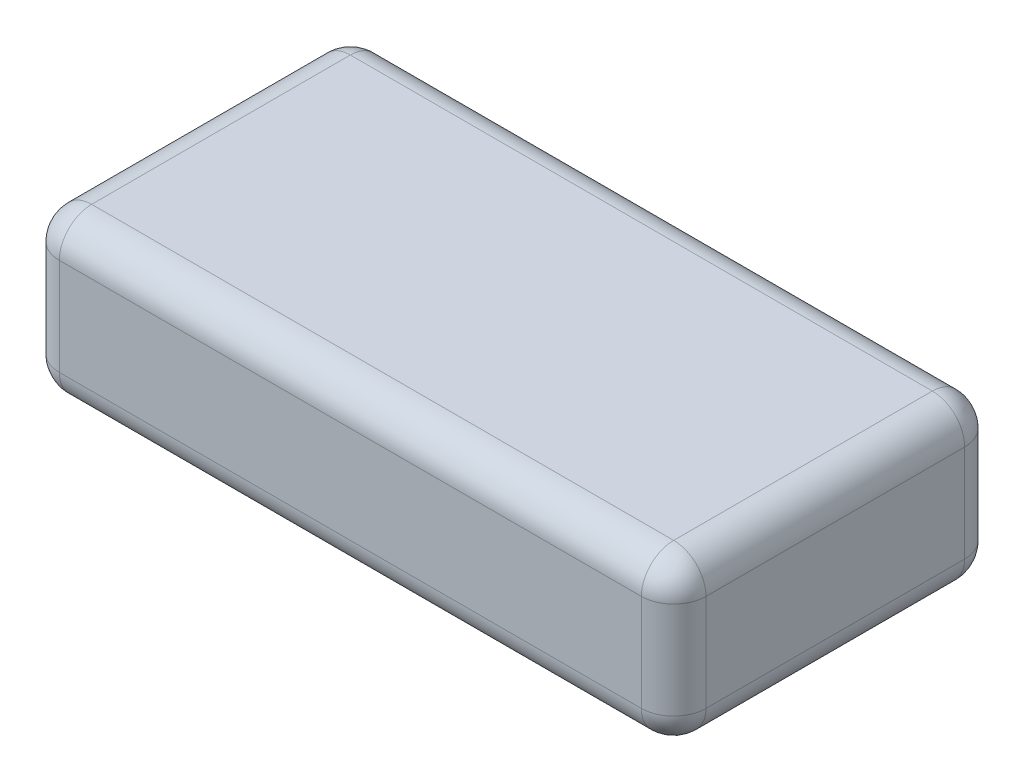
ISO-10303-21;
HEADER;
FILE_DESCRIPTION(('STEP AP214'),'2;1');
FILE_NAME('part.step','',(''),(''),'','','');
FILE_SCHEMA(('AUTOMOTIVE_DESIGN { 1 0 10303 214 1 1 1 1 }'));
ENDSEC;
DATA;
#1=APPLICATION_CONTEXT('core data for automotive mechanical design processes');
#2=APPLICATION_PROTOCOL_DEFINITION('international standard','automotive_design',2000,#1);
#3=PRODUCT_CONTEXT('',#1,'mechanical');
#4=PRODUCT('Part','Part','',(#3));
#5=PRODUCT_RELATED_PRODUCT_CATEGORY('part','',(#4));
#6=PRODUCT_DEFINITION_FORMATION('','',#4);
#7=PRODUCT_DEFINITION_CONTEXT('part definition',#1,'design');
#8=PRODUCT_DEFINITION('design','',#6,#7);
#9=PRODUCT_DEFINITION_SHAPE('','',#8);
#10=(LENGTH_UNIT() NAMED_UNIT(*) SI_UNIT(.MILLI.,.METRE.));
#11=(NAMED_UNIT(*) PLANE_ANGLE_UNIT() SI_UNIT($,.RADIAN.));
#12=(NAMED_UNIT(*) SI_UNIT($,.STERADIAN.) SOLID_ANGLE_UNIT());
#13=UNCERTAINTY_MEASURE_WITH_UNIT(LENGTH_MEASURE(1.E-05),#10,'distance_accuracy_value','');
#14=(GEOMETRIC_REPRESENTATION_CONTEXT(3) GLOBAL_UNCERTAINTY_ASSIGNED_CONTEXT((#13)) GLOBAL_UNIT_ASSIGNED_CONTEXT((#10,
#11,#12)) REPRESENTATION_CONTEXT('',''));
#15=CARTESIAN_POINT('',(0.,0.,0.));
#16=DIRECTION('',(0.,0.,1.));
#17=DIRECTION('',(1.,0.,0.));
#18=AXIS2_PLACEMENT_3D('',#15,#16,#17);
#19=CARTESIAN_POINT('',(0.,15.,0.));
#20=DIRECTION('',(1.,0.,0.));
#21=DIRECTION('',(0.,0.,-1.));
#22=AXIS2_PLACEMENT_3D('',#19,#20,#21);
#23=PLANE('',#22);
#24=DIRECTION('',(0.,0.,1.));
#25=VECTOR('',#24,1.);
#26=CARTESIAN_POINT('',(0.,12.,0.));
#27=LINE('',#26,#25);
#28=CARTESIAN_POINT('',(0.,12.,-3.));
#29=VERTEX_POINT('',#28);
#30=CARTESIAN_POINT('',(0.,12.,-27.));
#31=VERTEX_POINT('',#30);
#32=EDGE_CURVE('E222',#29,#31,#27,.F.);
#33=ORIENTED_EDGE('',*,*,#32,.T.);
#34=DIRECTION('',(0.,-1.,0.));
#35=VECTOR('',#34,1.);
#36=CARTESIAN_POINT('',(0.,15.,-27.));
#37=LINE('',#36,#35);
#38=CARTESIAN_POINT('',(0.,3.,-27.));
#39=VERTEX_POINT('',#38);
#40=EDGE_CURVE('E225',#31,#39,#37,.T.);
#41=ORIENTED_EDGE('',*,*,#40,.T.);
#42=DIRECTION('',(0.,0.,1.));
#43=VECTOR('',#42,1.);
#44=CARTESIAN_POINT('',(0.,3.,0.));
#45=LINE('',#44,#43);
#46=CARTESIAN_POINT('',(0.,3.,-3.));
#47=VERTEX_POINT('',#46);
#48=EDGE_CURVE('E216',#39,#47,#45,.T.);
#49=ORIENTED_EDGE('',*,*,#48,.T.);
#50=DIRECTION('',(0.,-1.,0.));
#51=VECTOR('',#50,1.);
#52=CARTESIAN_POINT('',(0.,15.,-3.));
#53=LINE('',#52,#51);
#54=EDGE_CURVE('E219',#47,#29,#53,.F.);
#55=ORIENTED_EDGE('',*,*,#54,.T.);
#56=EDGE_LOOP('',(#33,#41,#49,#55));
#57=FACE_BOUND('',#56,.T.);
#58=ADVANCED_FACE('F40',(#57),#23,.F.);
#59=CARTESIAN_POINT('',(0.,15.,0.));
#60=DIRECTION('',(0.,0.,-1.));
#61=DIRECTION('',(-1.,0.,0.));
#62=AXIS2_PLACEMENT_3D('',#59,#60,#61);
#63=PLANE('',#62);
#64=DIRECTION('',(1.,0.,0.));
#65=VECTOR('',#64,1.);
#66=CARTESIAN_POINT('',(0.,12.,0.));
#67=LINE('',#66,#65);
#68=CARTESIAN_POINT('',(57.,12.,0.));
#69=VERTEX_POINT('',#68);
#70=CARTESIAN_POINT('',(3.,12.,0.));
#71=VERTEX_POINT('',#70);
#72=EDGE_CURVE('E149',#69,#71,#67,.F.);
#73=ORIENTED_EDGE('',*,*,#72,.T.);
#74=DIRECTION('',(0.,-1.,0.));
#75=VECTOR('',#74,1.);
#76=CARTESIAN_POINT('',(3.,15.,0.));
#77=LINE('',#76,#75);
#78=CARTESIAN_POINT('',(3.,3.,0.));
#79=VERTEX_POINT('',#78);
#80=EDGE_CURVE('E213',#71,#79,#77,.T.);
#81=ORIENTED_EDGE('',*,*,#80,.T.);
#82=DIRECTION('',(1.,0.,0.));
#83=VECTOR('',#82,1.);
#84=CARTESIAN_POINT('',(60.,3.,0.));
#85=LINE('',#84,#83);
#86=CARTESIAN_POINT('',(57.,3.,0.));
#87=VERTEX_POINT('',#86);
#88=EDGE_CURVE('E208',#79,#87,#85,.T.);
#89=ORIENTED_EDGE('',*,*,#88,.T.);
#90=DIRECTION('',(0.,-1.,0.));
#91=VECTOR('',#90,1.);
#92=CARTESIAN_POINT('',(57.,15.,0.));
#93=LINE('',#92,#91);
#94=EDGE_CURVE('E205',#87,#69,#93,.F.);
#95=ORIENTED_EDGE('',*,*,#94,.T.);
#96=EDGE_LOOP('',(#73,#81,#89,#95));
#97=FACE_BOUND('',#96,.T.);
#98=ADVANCED_FACE('F350',(#97),#63,.F.);
#99=CARTESIAN_POINT('',(60.,15.,0.));
#100=DIRECTION('',(-1.,0.,0.));
#101=DIRECTION('',(0.,0.,1.));
#102=AXIS2_PLACEMENT_3D('',#99,#100,#101);
#103=PLANE('',#102);
#104=DIRECTION('',(0.,0.,-1.));
#105=VECTOR('',#104,1.);
#106=CARTESIAN_POINT('',(60.,12.,0.));
#107=LINE('',#106,#105);
#108=CARTESIAN_POINT('',(60.,12.,-27.));
#109=VERTEX_POINT('',#108);
#110=CARTESIAN_POINT('',(60.,12.,-3.));
#111=VERTEX_POINT('',#110);
#112=EDGE_CURVE('E50',#109,#111,#107,.F.);
#113=ORIENTED_EDGE('',*,*,#112,.T.);
#114=DIRECTION('',(0.,-1.,0.));
#115=VECTOR('',#114,1.);
#116=CARTESIAN_POINT('',(60.,15.,-3.));
#117=LINE('',#116,#115);
#118=CARTESIAN_POINT('',(60.,3.,-3.));
#119=VERTEX_POINT('',#118);
#120=EDGE_CURVE('E11',#111,#119,#117,.T.);
#121=ORIENTED_EDGE('',*,*,#120,.T.);
#122=DIRECTION('',(0.,0.,-1.));
#123=VECTOR('',#122,1.);
#124=CARTESIAN_POINT('',(60.,3.,-30.));
#125=LINE('',#124,#123);
#126=CARTESIAN_POINT('',(60.,3.,-27.));
#127=VERTEX_POINT('',#126);
#128=EDGE_CURVE('E229',#119,#127,#125,.T.);
#129=ORIENTED_EDGE('',*,*,#128,.T.);
#130=DIRECTION('',(0.,-1.,0.));
#131=VECTOR('',#130,1.);
#132=CARTESIAN_POINT('',(60.,15.,-27.));
#133=LINE('',#132,#131);
#134=EDGE_CURVE('E61',#127,#109,#133,.F.);
#135=ORIENTED_EDGE('',*,*,#134,.T.);
#136=EDGE_LOOP('',(#113,#121,#129,#135));
#137=FACE_BOUND('',#136,.T.);
#138=ADVANCED_FACE('F352',(#137),#103,.F.);
#139=CARTESIAN_POINT('',(0.,15.,-30.));
#140=DIRECTION('',(0.,0.,1.));
#141=DIRECTION('',(1.,0.,0.));
#142=AXIS2_PLACEMENT_3D('',#139,#140,#141);
#143=PLANE('',#142);
#144=DIRECTION('',(-1.,0.,0.));
#145=VECTOR('',#144,1.);
#146=CARTESIAN_POINT('',(0.,3.,-30.));
#147=LINE('',#146,#145);
#148=CARTESIAN_POINT('',(57.,3.,-30.));
#149=VERTEX_POINT('',#148);
#150=CARTESIAN_POINT('',(3.,3.,-30.));
#151=VERTEX_POINT('',#150);
#152=EDGE_CURVE('E182',#149,#151,#147,.T.);
#153=ORIENTED_EDGE('',*,*,#152,.T.);
#154=DIRECTION('',(0.,-1.,0.));
#155=VECTOR('',#154,1.);
#156=CARTESIAN_POINT('',(3.,15.,-30.));
#157=LINE('',#156,#155);
#158=CARTESIAN_POINT('',(3.,12.,-30.));
#159=VERTEX_POINT('',#158);
#160=EDGE_CURVE('E189',#151,#159,#157,.F.);
#161=ORIENTED_EDGE('',*,*,#160,.T.);
#162=DIRECTION('',(-1.,0.,0.));
#163=VECTOR('',#162,1.);
#164=CARTESIAN_POINT('',(0.,12.,-30.));
#165=LINE('',#164,#163);
#166=CARTESIAN_POINT('',(57.,12.,-30.));
#167=VERTEX_POINT('',#166);
#168=EDGE_CURVE('E185',#159,#167,#165,.F.);
#169=ORIENTED_EDGE('',*,*,#168,.T.);
#170=DIRECTION('',(0.,-1.,0.));
#171=VECTOR('',#170,1.);
#172=CARTESIAN_POINT('',(57.,15.,-30.));
#173=LINE('',#172,#171);
#174=EDGE_CURVE('E179',#167,#149,#173,.T.);
#175=ORIENTED_EDGE('',*,*,#174,.T.);
#176=EDGE_LOOP('',(#153,#161,#169,#175));
#177=FACE_BOUND('',#176,.T.);
#178=ADVANCED_FACE('F358',(#177),#143,.F.);
#179=CARTESIAN_POINT('',(0.,15.,0.));
#180=DIRECTION('',(0.,-1.,0.));
#181=DIRECTION('',(0.,0.,-1.));
#182=AXIS2_PLACEMENT_3D('',#179,#180,#181);
#183=PLANE('',#182);
#184=DIRECTION('',(-1.,0.,0.));
#185=VECTOR('',#184,1.);
#186=CARTESIAN_POINT('',(0.,15.,-27.));
#187=LINE('',#186,#185);
#188=CARTESIAN_POINT('',(57.,15.,-27.));
#189=VERTEX_POINT('',#188);
#190=CARTESIAN_POINT('',(3.,15.,-27.));
#191=VERTEX_POINT('',#190);
#192=EDGE_CURVE('E141',#189,#191,#187,.T.);
#193=ORIENTED_EDGE('',*,*,#192,.T.);
#194=DIRECTION('',(0.,0.,1.));
#195=VECTOR('',#194,1.);
#196=CARTESIAN_POINT('',(3.,15.,0.));
#197=LINE('',#196,#195);
#198=CARTESIAN_POINT('',(3.,15.,-3.));
#199=VERTEX_POINT('',#198);
#200=EDGE_CURVE('E136',#191,#199,#197,.T.);
#201=ORIENTED_EDGE('',*,*,#200,.T.);
#202=DIRECTION('',(1.,0.,0.));
#203=VECTOR('',#202,1.);
#204=CARTESIAN_POINT('',(0.,15.,-3.));
#205=LINE('',#204,#203);
#206=CARTESIAN_POINT('',(57.,15.,-3.));
#207=VERTEX_POINT('',#206);
#208=EDGE_CURVE('E128',#199,#207,#205,.T.);
#209=ORIENTED_EDGE('',*,*,#208,.T.);
#210=DIRECTION('',(0.,0.,-1.));
#211=VECTOR('',#210,1.);
#212=CARTESIAN_POINT('',(57.,15.,0.));
#213=LINE('',#212,#211);
#214=EDGE_CURVE('E133',#207,#189,#213,.T.);
#215=ORIENTED_EDGE('',*,*,#214,.T.);
#216=EDGE_LOOP('',(#193,#201,#209,#215));
#217=FACE_BOUND('',#216,.T.);
#218=ADVANCED_FACE('F131',(#217),#183,.F.);
#219=CARTESIAN_POINT('',(0.,0.,0.));
#220=DIRECTION('',(0.,-1.,0.));
#221=DIRECTION('',(0.,0.,-1.));
#222=AXIS2_PLACEMENT_3D('',#219,#220,#221);
#223=PLANE('',#222);
#224=DIRECTION('',(1.,0.,0.));
#225=VECTOR('',#224,1.);
#226=CARTESIAN_POINT('',(0.,0.,-3.));
#227=LINE('',#226,#225);
#228=CARTESIAN_POINT('',(57.,0.,-3.));
#229=VERTEX_POINT('',#228);
#230=CARTESIAN_POINT('',(3.,0.,-3.));
#231=VERTEX_POINT('',#230);
#232=EDGE_CURVE('E195',#229,#231,#227,.F.);
#233=ORIENTED_EDGE('',*,*,#232,.T.);
#234=DIRECTION('',(0.,0.,1.));
#235=VECTOR('',#234,1.);
#236=CARTESIAN_POINT('',(3.,0.,-30.));
#237=LINE('',#236,#235);
#238=CARTESIAN_POINT('',(3.,0.,-27.));
#239=VERTEX_POINT('',#238);
#240=EDGE_CURVE('E202',#231,#239,#237,.F.);
#241=ORIENTED_EDGE('',*,*,#240,.T.);
#242=DIRECTION('',(-1.,0.,0.));
#243=VECTOR('',#242,1.);
#244=CARTESIAN_POINT('',(60.,0.,-27.));
#245=LINE('',#244,#243);
#246=CARTESIAN_POINT('',(57.,0.,-27.));
#247=VERTEX_POINT('',#246);
#248=EDGE_CURVE('E198',#239,#247,#245,.F.);
#249=ORIENTED_EDGE('',*,*,#248,.T.);
#250=DIRECTION('',(0.,0.,-1.));
#251=VECTOR('',#250,1.);
#252=CARTESIAN_POINT('',(57.,0.,0.));
#253=LINE('',#252,#251);
#254=EDGE_CURVE('E192',#247,#229,#253,.F.);
#255=ORIENTED_EDGE('',*,*,#254,.T.);
#256=EDGE_LOOP('',(#233,#241,#249,#255));
#257=FACE_BOUND('',#256,.T.);
#258=ADVANCED_FACE('F328',(#257),#223,.T.);
#259=CARTESIAN_POINT('',(0.,3.,-3.));
#260=DIRECTION('',(-1.,0.,0.));
#261=DIRECTION('',(0.,0.,1.));
#262=AXIS2_PLACEMENT_3D('',#259,#260,#261);
#263=CYLINDRICAL_SURFACE('',#262,3.);
#264=CARTESIAN_POINT('',(57.,3.,-3.));
#265=DIRECTION('',(1.,0.,0.));
#266=DIRECTION('',(0.,0.,-1.));
#267=AXIS2_PLACEMENT_3D('',#264,#265,#266);
#268=CIRCLE('',#267,3.);
#269=EDGE_CURVE('E44',#87,#229,#268,.T.);
#270=ORIENTED_EDGE('',*,*,#269,.F.);
#271=ORIENTED_EDGE('',*,*,#88,.F.);
#272=CARTESIAN_POINT('',(3.,3.,-3.));
#273=DIRECTION('',(-1.,0.,0.));
#274=DIRECTION('',(0.,0.,1.));
#275=AXIS2_PLACEMENT_3D('',#272,#273,#274);
#276=CIRCLE('',#275,3.);
#277=EDGE_CURVE('E173',#231,#79,#276,.T.);
#278=ORIENTED_EDGE('',*,*,#277,.F.);
#279=ORIENTED_EDGE('',*,*,#232,.F.);
#280=EDGE_LOOP('',(#270,#271,#278,#279));
#281=FACE_BOUND('',#280,.T.);
#282=ADVANCED_FACE('F42',(#281),#263,.T.);
#283=CARTESIAN_POINT('',(57.,3.,-3.));
#284=DIRECTION('',(0.,0.,1.));
#285=DIRECTION('',(1.,0.,0.));
#286=AXIS2_PLACEMENT_3D('',#283,#284,#285);
#287=SPHERICAL_SURFACE('',#286,3.);
#288=CARTESIAN_POINT('',(57.,3.,-3.));
#289=DIRECTION('',(0.,-1.,0.));
#290=DIRECTION('',(0.,0.,-1.));
#291=AXIS2_PLACEMENT_3D('',#288,#289,#290);
#292=CIRCLE('',#291,3.);
#293=EDGE_CURVE('E295',#87,#119,#292,.F.);
#294=ORIENTED_EDGE('',*,*,#293,.F.);
#295=ORIENTED_EDGE('',*,*,#269,.T.);
#296=CARTESIAN_POINT('',(57.,3.,-3.));
#297=DIRECTION('',(0.,0.,1.));
#298=DIRECTION('',(1.,0.,0.));
#299=AXIS2_PLACEMENT_3D('',#296,#297,#298);
#300=CIRCLE('',#299,3.);
#301=EDGE_CURVE('E299',#119,#229,#300,.F.);
#302=ORIENTED_EDGE('',*,*,#301,.F.);
#303=EDGE_LOOP('',(#294,#295,#302));
#304=FACE_BOUND('',#303,.T.);
#305=ADVANCED_FACE('F345',(#304),#287,.T.);
#306=CARTESIAN_POINT('',(3.,3.,-3.));
#307=DIRECTION('',(0.,0.,1.));
#308=DIRECTION('',(1.,0.,0.));
#309=AXIS2_PLACEMENT_3D('',#306,#307,#308);
#310=SPHERICAL_SURFACE('',#309,3.);
#311=CARTESIAN_POINT('',(3.,3.,-3.));
#312=DIRECTION('',(0.,0.,1.));
#313=DIRECTION('',(1.,0.,0.));
#314=AXIS2_PLACEMENT_3D('',#311,#312,#313);
#315=CIRCLE('',#314,3.);
#316=EDGE_CURVE('E287',#231,#47,#315,.F.);
#317=ORIENTED_EDGE('',*,*,#316,.F.);
#318=ORIENTED_EDGE('',*,*,#277,.T.);
#319=CARTESIAN_POINT('',(3.,3.,-3.));
#320=DIRECTION('',(0.,-1.,0.));
#321=DIRECTION('',(0.,0.,-1.));
#322=AXIS2_PLACEMENT_3D('',#319,#320,#321);
#323=CIRCLE('',#322,3.);
#324=EDGE_CURVE('E291',#47,#79,#323,.F.);
#325=ORIENTED_EDGE('',*,*,#324,.F.);
#326=EDGE_LOOP('',(#317,#318,#325));
#327=FACE_BOUND('',#326,.T.);
#328=ADVANCED_FACE('F308',(#327),#310,.T.);
#329=CARTESIAN_POINT('',(57.,3.,0.));
#330=DIRECTION('',(0.,0.,1.));
#331=DIRECTION('',(1.,0.,0.));
#332=AXIS2_PLACEMENT_3D('',#329,#330,#331);
#333=CYLINDRICAL_SURFACE('',#332,3.);
#334=ORIENTED_EDGE('',*,*,#301,.T.);
#335=ORIENTED_EDGE('',*,*,#254,.F.);
#336=CARTESIAN_POINT('',(57.,3.,-27.));
#337=DIRECTION('',(0.,0.,-1.));
#338=DIRECTION('',(-1.,0.,0.));
#339=AXIS2_PLACEMENT_3D('',#336,#337,#338);
#340=CIRCLE('',#339,3.);
#341=EDGE_CURVE('E280',#127,#247,#340,.T.);
#342=ORIENTED_EDGE('',*,*,#341,.F.);
#343=ORIENTED_EDGE('',*,*,#128,.F.);
#344=EDGE_LOOP('',(#334,#335,#342,#343));
#345=FACE_BOUND('',#344,.T.);
#346=ADVANCED_FACE('F340',(#345),#333,.T.);
#347=CARTESIAN_POINT('',(57.,15.,-3.));
#348=DIRECTION('',(0.,-1.,0.));
#349=DIRECTION('',(0.,0.,-1.));
#350=AXIS2_PLACEMENT_3D('',#347,#348,#349);
#351=CYLINDRICAL_SURFACE('',#350,3.);
#352=ORIENTED_EDGE('',*,*,#293,.T.);
#353=ORIENTED_EDGE('',*,*,#120,.F.);
#354=CARTESIAN_POINT('',(57.,12.,-3.));
#355=DIRECTION('',(0.,1.,0.));
#356=DIRECTION('',(0.,0.,1.));
#357=AXIS2_PLACEMENT_3D('',#354,#355,#356);
#358=CIRCLE('',#357,3.);
#359=EDGE_CURVE('E154',#69,#111,#358,.T.);
#360=ORIENTED_EDGE('',*,*,#359,.F.);
#361=ORIENTED_EDGE('',*,*,#94,.F.);
#362=EDGE_LOOP('',(#352,#353,#360,#361));
#363=FACE_BOUND('',#362,.T.);
#364=ADVANCED_FACE('F348',(#363),#351,.T.);
#365=CARTESIAN_POINT('',(0.,12.,-3.));
#366=DIRECTION('',(1.,0.,0.));
#367=DIRECTION('',(0.,0.,-1.));
#368=AXIS2_PLACEMENT_3D('',#365,#366,#367);
#369=CYLINDRICAL_SURFACE('',#368,3.);
#370=CARTESIAN_POINT('',(3.,12.,-3.));
#371=DIRECTION('',(-1.,0.,0.));
#372=DIRECTION('',(0.,0.,1.));
#373=AXIS2_PLACEMENT_3D('',#370,#371,#372);
#374=CIRCLE('',#373,3.);
#375=EDGE_CURVE('E155',#71,#199,#374,.T.);
#376=ORIENTED_EDGE('',*,*,#375,.F.);
#377=ORIENTED_EDGE('',*,*,#72,.F.);
#378=CARTESIAN_POINT('',(57.,12.,-3.));
#379=DIRECTION('',(1.,0.,0.));
#380=DIRECTION('',(0.,0.,-1.));
#381=AXIS2_PLACEMENT_3D('',#378,#379,#380);
#382=CIRCLE('',#381,3.);
#383=EDGE_CURVE('E145',#207,#69,#382,.T.);
#384=ORIENTED_EDGE('',*,*,#383,.F.);
#385=ORIENTED_EDGE('',*,*,#208,.F.);
#386=EDGE_LOOP('',(#376,#377,#384,#385));
#387=FACE_BOUND('',#386,.T.);
#388=ADVANCED_FACE('F147',(#387),#369,.T.);
#389=CARTESIAN_POINT('',(3.,15.,-3.));
#390=DIRECTION('',(0.,-1.,0.));
#391=DIRECTION('',(0.,0.,-1.));
#392=AXIS2_PLACEMENT_3D('',#389,#390,#391);
#393=CYLINDRICAL_SURFACE('',#392,3.);
#394=ORIENTED_EDGE('',*,*,#324,.T.);
#395=ORIENTED_EDGE('',*,*,#80,.F.);
#396=CARTESIAN_POINT('',(3.,12.,-3.));
#397=DIRECTION('',(0.,1.,0.));
#398=DIRECTION('',(0.,0.,1.));
#399=AXIS2_PLACEMENT_3D('',#396,#397,#398);
#400=CIRCLE('',#399,3.);
#401=EDGE_CURVE('E273',#29,#71,#400,.T.);
#402=ORIENTED_EDGE('',*,*,#401,.F.);
#403=ORIENTED_EDGE('',*,*,#54,.F.);
#404=EDGE_LOOP('',(#394,#395,#402,#403));
#405=FACE_BOUND('',#404,.T.);
#406=ADVANCED_FACE('F316',(#405),#393,.T.);
#407=CARTESIAN_POINT('',(3.,3.,0.));
#408=DIRECTION('',(0.,0.,-1.));
#409=DIRECTION('',(-1.,0.,0.));
#410=AXIS2_PLACEMENT_3D('',#407,#408,#409);
#411=CYLINDRICAL_SURFACE('',#410,3.);
#412=ORIENTED_EDGE('',*,*,#316,.T.);
#413=ORIENTED_EDGE('',*,*,#48,.F.);
#414=CARTESIAN_POINT('',(3.,3.,-27.));
#415=DIRECTION('',(0.,0.,-1.));
#416=DIRECTION('',(-1.,0.,0.));
#417=AXIS2_PLACEMENT_3D('',#414,#415,#416);
#418=CIRCLE('',#417,3.);
#419=EDGE_CURVE('E269',#239,#39,#418,.T.);
#420=ORIENTED_EDGE('',*,*,#419,.F.);
#421=ORIENTED_EDGE('',*,*,#240,.F.);
#422=EDGE_LOOP('',(#412,#413,#420,#421));
#423=FACE_BOUND('',#422,.T.);
#424=ADVANCED_FACE('F325',(#423),#411,.T.);
#425=CARTESIAN_POINT('',(0.,3.,-27.));
#426=DIRECTION('',(1.,0.,0.));
#427=DIRECTION('',(0.,0.,-1.));
#428=AXIS2_PLACEMENT_3D('',#425,#426,#427);
#429=CYLINDRICAL_SURFACE('',#428,3.);
#430=CARTESIAN_POINT('',(57.,3.,-27.));
#431=DIRECTION('',(1.,0.,0.));
#432=DIRECTION('',(0.,0.,-1.));
#433=AXIS2_PLACEMENT_3D('',#430,#431,#432);
#434=CIRCLE('',#433,3.);
#435=EDGE_CURVE('E283',#247,#149,#434,.T.);
#436=ORIENTED_EDGE('',*,*,#435,.F.);
#437=ORIENTED_EDGE('',*,*,#248,.F.);
#438=CARTESIAN_POINT('',(3.,3.,-27.));
#439=DIRECTION('',(-1.,0.,0.));
#440=DIRECTION('',(0.,0.,1.));
#441=AXIS2_PLACEMENT_3D('',#438,#439,#440);
#442=CIRCLE('',#441,3.);
#443=EDGE_CURVE('E265',#151,#239,#442,.T.);
#444=ORIENTED_EDGE('',*,*,#443,.F.);
#445=ORIENTED_EDGE('',*,*,#152,.F.);
#446=EDGE_LOOP('',(#436,#437,#444,#445));
#447=FACE_BOUND('',#446,.T.);
#448=ADVANCED_FACE('F332',(#447),#429,.T.);
#449=CARTESIAN_POINT('',(57.,3.,-27.));
#450=DIRECTION('',(0.,0.,1.));
#451=DIRECTION('',(1.,0.,0.));
#452=AXIS2_PLACEMENT_3D('',#449,#450,#451);
#453=SPHERICAL_SURFACE('',#452,3.);
#454=ORIENTED_EDGE('',*,*,#341,.T.);
#455=ORIENTED_EDGE('',*,*,#435,.T.);
#456=CARTESIAN_POINT('',(57.,3.,-27.));
#457=DIRECTION('',(0.,-1.,0.));
#458=DIRECTION('',(0.,0.,-1.));
#459=AXIS2_PLACEMENT_3D('',#456,#457,#458);
#460=CIRCLE('',#459,3.);
#461=EDGE_CURVE('E162',#127,#149,#460,.F.);
#462=ORIENTED_EDGE('',*,*,#461,.F.);
#463=EDGE_LOOP('',(#454,#455,#462));
#464=FACE_BOUND('',#463,.T.);
#465=ADVANCED_FACE('F399',(#464),#453,.T.);
#466=CARTESIAN_POINT('',(57.,12.,-3.));
#467=DIRECTION('',(0.,0.,1.));
#468=DIRECTION('',(1.,0.,0.));
#469=AXIS2_PLACEMENT_3D('',#466,#467,#468);
#470=SPHERICAL_SURFACE('',#469,3.);
#471=ORIENTED_EDGE('',*,*,#383,.T.);
#472=ORIENTED_EDGE('',*,*,#359,.T.);
#473=CARTESIAN_POINT('',(57.,12.,-3.));
#474=DIRECTION('',(0.,0.,1.));
#475=DIRECTION('',(1.,0.,0.));
#476=AXIS2_PLACEMENT_3D('',#473,#474,#475);
#477=CIRCLE('',#476,3.);
#478=EDGE_CURVE('E158',#207,#111,#477,.F.);
#479=ORIENTED_EDGE('',*,*,#478,.F.);
#480=EDGE_LOOP('',(#471,#472,#479));
#481=FACE_BOUND('',#480,.T.);
#482=ADVANCED_FACE('F159',(#481),#470,.T.);
#483=CARTESIAN_POINT('',(3.,12.,-3.));
#484=DIRECTION('',(0.,0.,1.));
#485=DIRECTION('',(1.,0.,0.));
#486=AXIS2_PLACEMENT_3D('',#483,#484,#485);
#487=SPHERICAL_SURFACE('',#486,3.);
#488=ORIENTED_EDGE('',*,*,#401,.T.);
#489=ORIENTED_EDGE('',*,*,#375,.T.);
#490=CARTESIAN_POINT('',(3.,12.,-3.));
#491=DIRECTION('',(0.,0.,1.));
#492=DIRECTION('',(1.,0.,0.));
#493=AXIS2_PLACEMENT_3D('',#490,#491,#492);
#494=CIRCLE('',#493,3.);
#495=EDGE_CURVE('E163',#29,#199,#494,.F.);
#496=ORIENTED_EDGE('',*,*,#495,.F.);
#497=EDGE_LOOP('',(#488,#489,#496));
#498=FACE_BOUND('',#497,.T.);
#499=ADVANCED_FACE('F392',(#498),#487,.T.);
#500=CARTESIAN_POINT('',(3.,3.,-27.));
#501=DIRECTION('',(0.,0.,1.));
#502=DIRECTION('',(1.,0.,0.));
#503=AXIS2_PLACEMENT_3D('',#500,#501,#502);
#504=SPHERICAL_SURFACE('',#503,3.);
#505=ORIENTED_EDGE('',*,*,#443,.T.);
#506=ORIENTED_EDGE('',*,*,#419,.T.);
#507=CARTESIAN_POINT('',(3.,3.,-27.));
#508=DIRECTION('',(0.,-1.,0.));
#509=DIRECTION('',(0.,0.,-1.));
#510=AXIS2_PLACEMENT_3D('',#507,#508,#509);
#511=CIRCLE('',#510,3.);
#512=EDGE_CURVE('E256',#151,#39,#511,.F.);
#513=ORIENTED_EDGE('',*,*,#512,.F.);
#514=EDGE_LOOP('',(#505,#506,#513));
#515=FACE_BOUND('',#514,.T.);
#516=ADVANCED_FACE('F388',(#515),#504,.T.);
#517=CARTESIAN_POINT('',(57.,15.,-27.));
#518=DIRECTION('',(0.,-1.,0.));
#519=DIRECTION('',(0.,0.,-1.));
#520=AXIS2_PLACEMENT_3D('',#517,#518,#519);
#521=CYLINDRICAL_SURFACE('',#520,3.);
#522=ORIENTED_EDGE('',*,*,#461,.T.);
#523=ORIENTED_EDGE('',*,*,#174,.F.);
#524=CARTESIAN_POINT('',(57.,12.,-27.));
#525=DIRECTION('',(0.,1.,0.));
#526=DIRECTION('',(0.,0.,1.));
#527=AXIS2_PLACEMENT_3D('',#524,#525,#526);
#528=CIRCLE('',#527,3.);
#529=EDGE_CURVE('E252',#109,#167,#528,.T.);
#530=ORIENTED_EDGE('',*,*,#529,.F.);
#531=ORIENTED_EDGE('',*,*,#134,.F.);
#532=EDGE_LOOP('',(#522,#523,#530,#531));
#533=FACE_BOUND('',#532,.T.);
#534=ADVANCED_FACE('F385',(#533),#521,.T.);
#535=CARTESIAN_POINT('',(57.,12.,0.));
#536=DIRECTION('',(0.,0.,-1.));
#537=DIRECTION('',(-1.,0.,0.));
#538=AXIS2_PLACEMENT_3D('',#535,#536,#537);
#539=CYLINDRICAL_SURFACE('',#538,3.);
#540=ORIENTED_EDGE('',*,*,#478,.T.);
#541=ORIENTED_EDGE('',*,*,#112,.F.);
#542=CARTESIAN_POINT('',(57.,12.,-27.));
#543=DIRECTION('',(0.,0.,-1.));
#544=DIRECTION('',(-1.,0.,0.));
#545=AXIS2_PLACEMENT_3D('',#542,#543,#544);
#546=CIRCLE('',#545,3.);
#547=EDGE_CURVE('E167',#189,#109,#546,.T.);
#548=ORIENTED_EDGE('',*,*,#547,.F.);
#549=ORIENTED_EDGE('',*,*,#214,.F.);
#550=EDGE_LOOP('',(#540,#541,#548,#549));
#551=FACE_BOUND('',#550,.T.);
#552=ADVANCED_FACE('F165',(#551),#539,.T.);
#553=CARTESIAN_POINT('',(3.,12.,0.));
#554=DIRECTION('',(0.,0.,1.));
#555=DIRECTION('',(1.,0.,0.));
#556=AXIS2_PLACEMENT_3D('',#553,#554,#555);
#557=CYLINDRICAL_SURFACE('',#556,3.);
#558=ORIENTED_EDGE('',*,*,#495,.T.);
#559=ORIENTED_EDGE('',*,*,#200,.F.);
#560=CARTESIAN_POINT('',(3.,12.,-27.));
#561=DIRECTION('',(0.,0.,-1.));
#562=DIRECTION('',(-1.,0.,0.));
#563=AXIS2_PLACEMENT_3D('',#560,#561,#562);
#564=CIRCLE('',#563,3.);
#565=EDGE_CURVE('E246',#31,#191,#564,.T.);
#566=ORIENTED_EDGE('',*,*,#565,.F.);
#567=ORIENTED_EDGE('',*,*,#32,.F.);
#568=EDGE_LOOP('',(#558,#559,#566,#567));
#569=FACE_BOUND('',#568,.T.);
#570=ADVANCED_FACE('F378',(#569),#557,.T.);
#571=CARTESIAN_POINT('',(3.,15.,-27.));
#572=DIRECTION('',(0.,-1.,0.));
#573=DIRECTION('',(0.,0.,-1.));
#574=AXIS2_PLACEMENT_3D('',#571,#572,#573);
#575=CYLINDRICAL_SURFACE('',#574,3.);
#576=ORIENTED_EDGE('',*,*,#512,.T.);
#577=ORIENTED_EDGE('',*,*,#40,.F.);
#578=CARTESIAN_POINT('',(3.,12.,-27.));
#579=DIRECTION('',(0.,1.,0.));
#580=DIRECTION('',(0.,0.,1.));
#581=AXIS2_PLACEMENT_3D('',#578,#579,#580);
#582=CIRCLE('',#581,3.);
#583=EDGE_CURVE('E242',#159,#31,#582,.T.);
#584=ORIENTED_EDGE('',*,*,#583,.F.);
#585=ORIENTED_EDGE('',*,*,#160,.F.);
#586=EDGE_LOOP('',(#576,#577,#584,#585));
#587=FACE_BOUND('',#586,.T.);
#588=ADVANCED_FACE('F374',(#587),#575,.T.);
#589=CARTESIAN_POINT('',(57.,12.,-27.));
#590=DIRECTION('',(0.,0.,1.));
#591=DIRECTION('',(1.,0.,0.));
#592=AXIS2_PLACEMENT_3D('',#589,#590,#591);
#593=SPHERICAL_SURFACE('',#592,3.);
#594=ORIENTED_EDGE('',*,*,#547,.T.);
#595=ORIENTED_EDGE('',*,*,#529,.T.);
#596=CARTESIAN_POINT('',(57.,12.,-27.));
#597=DIRECTION('',(1.,0.,0.));
#598=DIRECTION('',(0.,0.,-1.));
#599=AXIS2_PLACEMENT_3D('',#596,#597,#598);
#600=CIRCLE('',#599,3.);
#601=EDGE_CURVE('E239',#189,#167,#600,.F.);
#602=ORIENTED_EDGE('',*,*,#601,.F.);
#603=EDGE_LOOP('',(#594,#595,#602));
#604=FACE_BOUND('',#603,.T.);
#605=ADVANCED_FACE('F370',(#604),#593,.T.);
#606=CARTESIAN_POINT('',(3.,12.,-27.));
#607=DIRECTION('',(0.,0.,1.));
#608=DIRECTION('',(1.,0.,0.));
#609=AXIS2_PLACEMENT_3D('',#606,#607,#608);
#610=SPHERICAL_SURFACE('',#609,3.);
#611=ORIENTED_EDGE('',*,*,#583,.T.);
#612=ORIENTED_EDGE('',*,*,#565,.T.);
#613=CARTESIAN_POINT('',(3.,12.,-27.));
#614=DIRECTION('',(-1.,0.,0.));
#615=DIRECTION('',(0.,0.,1.));
#616=AXIS2_PLACEMENT_3D('',#613,#614,#615);
#617=CIRCLE('',#616,3.);
#618=EDGE_CURVE('E236',#159,#191,#617,.F.);
#619=ORIENTED_EDGE('',*,*,#618,.F.);
#620=EDGE_LOOP('',(#611,#612,#619));
#621=FACE_BOUND('',#620,.T.);
#622=ADVANCED_FACE('F366',(#621),#610,.T.);
#623=CARTESIAN_POINT('',(0.,12.,-27.));
#624=DIRECTION('',(-1.,0.,0.));
#625=DIRECTION('',(0.,0.,1.));
#626=AXIS2_PLACEMENT_3D('',#623,#624,#625);
#627=CYLINDRICAL_SURFACE('',#626,3.);
#628=ORIENTED_EDGE('',*,*,#601,.T.);
#629=ORIENTED_EDGE('',*,*,#168,.F.);
#630=ORIENTED_EDGE('',*,*,#618,.T.);
#631=ORIENTED_EDGE('',*,*,#192,.F.);
#632=EDGE_LOOP('',(#628,#629,#630,#631));
#633=FACE_BOUND('',#632,.T.);
#634=ADVANCED_FACE('F363',(#633),#627,.T.);
#635=CLOSED_SHELL('',(#58,#98,#138,#178,#218,#258,#282,#305,#328,#346,#364,#388,#406,#424,#448,
#465,#482,#499,#516,#534,#552,#570,#588,#605,#622,#634));
#636=MANIFOLD_SOLID_BREP('B2',#635);
#637=ADVANCED_BREP_SHAPE_REPRESENTATION('',(#18,#636),#14);
#638=SHAPE_DEFINITION_REPRESENTATION(#9,#637);
ENDSEC;
END-ISO-10303-21;
